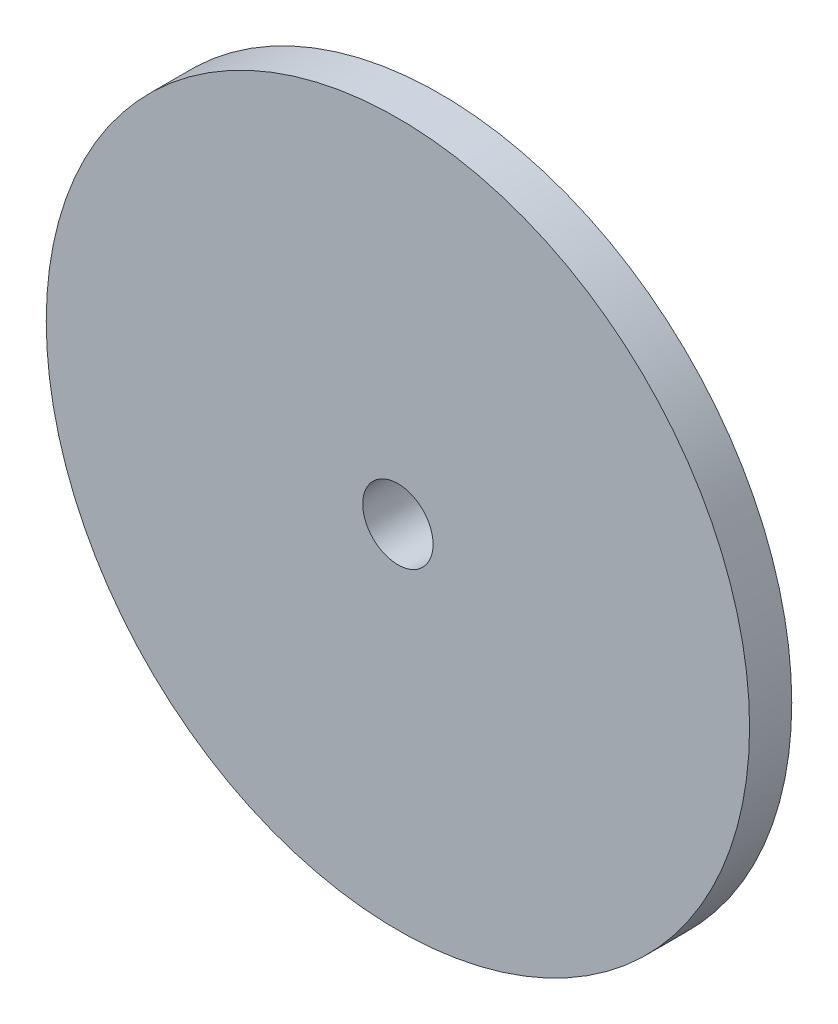
ISO-10303-21;
HEADER;
FILE_DESCRIPTION(('STEP AP214'),'2;1');
FILE_NAME('part.step','',(''),(''),'','','');
FILE_SCHEMA(('AUTOMOTIVE_DESIGN { 1 0 10303 214 1 1 1 1 }'));
ENDSEC;
DATA;
#1=APPLICATION_CONTEXT('core data for automotive mechanical design processes');
#2=APPLICATION_PROTOCOL_DEFINITION('international standard','automotive_design',2000,#1);
#3=PRODUCT_CONTEXT('',#1,'mechanical');
#4=PRODUCT('Part','Part','',(#3));
#5=PRODUCT_RELATED_PRODUCT_CATEGORY('part','',(#4));
#6=PRODUCT_DEFINITION_FORMATION('','',#4);
#7=PRODUCT_DEFINITION_CONTEXT('part definition',#1,'design');
#8=PRODUCT_DEFINITION('design','',#6,#7);
#9=PRODUCT_DEFINITION_SHAPE('','',#8);
#10=(LENGTH_UNIT() NAMED_UNIT(*) SI_UNIT(.MILLI.,.METRE.));
#11=(NAMED_UNIT(*) PLANE_ANGLE_UNIT() SI_UNIT($,.RADIAN.));
#12=(NAMED_UNIT(*) SI_UNIT($,.STERADIAN.) SOLID_ANGLE_UNIT());
#13=UNCERTAINTY_MEASURE_WITH_UNIT(LENGTH_MEASURE(1.E-05),#10,'distance_accuracy_value','');
#14=(GEOMETRIC_REPRESENTATION_CONTEXT(3) GLOBAL_UNCERTAINTY_ASSIGNED_CONTEXT((#13)) GLOBAL_UNIT_ASSIGNED_CONTEXT((#10,
#11,#12)) REPRESENTATION_CONTEXT('',''));
#15=CARTESIAN_POINT('',(0.,0.,0.));
#16=DIRECTION('',(0.,0.,1.));
#17=DIRECTION('',(1.,0.,0.));
#18=AXIS2_PLACEMENT_3D('',#15,#16,#17);
#19=CARTESIAN_POINT('',(-27.2623789677693,0.,-0.4));
#20=DIRECTION('',(0.,0.,1.));
#21=DIRECTION('',(1.,0.,0.));
#22=AXIS2_PLACEMENT_3D('',#19,#20,#21);
#23=CYLINDRICAL_SURFACE('',#22,1.25);
#24=CARTESIAN_POINT('',(-27.2623789677693,0.,-0.4));
#25=DIRECTION('',(0.,0.,1.));
#26=DIRECTION('',(1.,0.,0.));
#27=AXIS2_PLACEMENT_3D('',#24,#25,#26);
#28=CIRCLE('',#27,1.25);
#29=CARTESIAN_POINT('',(-26.0123789677693,0.,-0.4));
#30=VERTEX_POINT('',#29);
#31=EDGE_CURVE('E39',#30,#30,#28,.T.);
#32=ORIENTED_EDGE('',*,*,#31,.F.);
#33=EDGE_LOOP('',(#32));
#34=FACE_BOUND('',#33,.T.);
#35=CARTESIAN_POINT('',(-27.2623789677693,0.,1.5));
#36=DIRECTION('',(0.,0.,1.));
#37=DIRECTION('',(1.,0.,0.));
#38=AXIS2_PLACEMENT_3D('',#35,#36,#37);
#39=CIRCLE('',#38,1.25);
#40=CARTESIAN_POINT('',(-26.0123789677693,0.,1.5));
#41=VERTEX_POINT('',#40);
#42=EDGE_CURVE('E49',#41,#41,#39,.T.);
#43=ORIENTED_EDGE('',*,*,#42,.T.);
#44=EDGE_LOOP('',(#43));
#45=FACE_BOUND('',#44,.T.);
#46=ADVANCED_FACE('F32',(#34,#45),#23,.F.);
#47=CARTESIAN_POINT('',(-27.2623789677693,0.,-0.4));
#48=DIRECTION('',(0.,0.,1.));
#49=DIRECTION('',(1.,0.,0.));
#50=AXIS2_PLACEMENT_3D('',#47,#48,#49);
#51=CYLINDRICAL_SURFACE('',#50,6.);
#52=CARTESIAN_POINT('',(-27.2623789677693,0.,-0.4));
#53=DIRECTION('',(0.,0.,1.));
#54=DIRECTION('',(1.,0.,0.));
#55=AXIS2_PLACEMENT_3D('',#52,#53,#54);
#56=CIRCLE('',#55,6.);
#57=CARTESIAN_POINT('',(-21.2623789677693,0.,-0.4));
#58=VERTEX_POINT('',#57);
#59=EDGE_CURVE('E10',#58,#58,#56,.T.);
#60=ORIENTED_EDGE('',*,*,#59,.T.);
#61=EDGE_LOOP('',(#60));
#62=FACE_BOUND('',#61,.T.);
#63=CARTESIAN_POINT('',(-27.2623789677693,0.,0.));
#64=DIRECTION('',(0.,0.,1.));
#65=DIRECTION('',(1.,0.,0.));
#66=AXIS2_PLACEMENT_3D('',#63,#64,#65);
#67=CIRCLE('',#66,6.);
#68=CARTESIAN_POINT('',(-21.2623789677693,0.,0.));
#69=VERTEX_POINT('',#68);
#70=EDGE_CURVE('E35',#69,#69,#67,.T.);
#71=ORIENTED_EDGE('',*,*,#70,.F.);
#72=EDGE_LOOP('',(#71));
#73=FACE_BOUND('',#72,.T.);
#74=ADVANCED_FACE('F75',(#62,#73),#51,.T.);
#75=CARTESIAN_POINT('',(0.,0.,-0.4));
#76=DIRECTION('',(0.,0.,1.));
#77=DIRECTION('',(1.,0.,0.));
#78=AXIS2_PLACEMENT_3D('',#75,#76,#77);
#79=PLANE('',#78);
#80=ORIENTED_EDGE('',*,*,#31,.T.);
#81=EDGE_LOOP('',(#80));
#82=FACE_BOUND('',#81,.T.);
#83=ORIENTED_EDGE('',*,*,#59,.F.);
#84=EDGE_LOOP('',(#83));
#85=FACE_BOUND('',#84,.T.);
#86=ADVANCED_FACE('F61',(#82,#85),#79,.F.);
#87=CARTESIAN_POINT('',(-27.2623789677693,0.,1.5));
#88=DIRECTION('',(0.,0.,-1.));
#89=DIRECTION('',(-1.,0.,0.));
#90=AXIS2_PLACEMENT_3D('',#87,#88,#89);
#91=CYLINDRICAL_SURFACE('',#90,12.5);
#92=CARTESIAN_POINT('',(-27.2623789677693,0.,1.5));
#93=DIRECTION('',(0.,0.,1.));
#94=DIRECTION('',(1.,0.,0.));
#95=AXIS2_PLACEMENT_3D('',#92,#93,#94);
#96=CIRCLE('',#95,12.5);
#97=CARTESIAN_POINT('',(-14.7623789677693,0.,1.5));
#98=VERTEX_POINT('',#97);
#99=EDGE_CURVE('E48',#98,#98,#96,.T.);
#100=ORIENTED_EDGE('',*,*,#99,.F.);
#101=EDGE_LOOP('',(#100));
#102=FACE_BOUND('',#101,.T.);
#103=CARTESIAN_POINT('',(-27.2623789677693,0.,0.));
#104=DIRECTION('',(0.,0.,1.));
#105=DIRECTION('',(1.,0.,0.));
#106=AXIS2_PLACEMENT_3D('',#103,#104,#105);
#107=CIRCLE('',#106,12.5);
#108=CARTESIAN_POINT('',(-14.7623789677693,0.,0.));
#109=VERTEX_POINT('',#108);
#110=EDGE_CURVE('E45',#109,#109,#107,.T.);
#111=ORIENTED_EDGE('',*,*,#110,.T.);
#112=EDGE_LOOP('',(#111));
#113=FACE_BOUND('',#112,.T.);
#114=ADVANCED_FACE('F58',(#102,#113),#91,.T.);
#115=CARTESIAN_POINT('',(0.,0.,1.5));
#116=DIRECTION('',(0.,0.,1.));
#117=DIRECTION('',(1.,0.,0.));
#118=AXIS2_PLACEMENT_3D('',#115,#116,#117);
#119=PLANE('',#118);
#120=ORIENTED_EDGE('',*,*,#99,.T.);
#121=EDGE_LOOP('',(#120));
#122=FACE_BOUND('',#121,.T.);
#123=ORIENTED_EDGE('',*,*,#42,.F.);
#124=EDGE_LOOP('',(#123));
#125=FACE_BOUND('',#124,.T.);
#126=ADVANCED_FACE('F55',(#122,#125),#119,.T.);
#127=CARTESIAN_POINT('',(0.,0.,0.));
#128=DIRECTION('',(0.,0.,1.));
#129=DIRECTION('',(1.,0.,0.));
#130=AXIS2_PLACEMENT_3D('',#127,#128,#129);
#131=PLANE('',#130);
#132=ORIENTED_EDGE('',*,*,#70,.T.);
#133=EDGE_LOOP('',(#132));
#134=FACE_BOUND('',#133,.T.);
#135=ORIENTED_EDGE('',*,*,#110,.F.);
#136=EDGE_LOOP('',(#135));
#137=FACE_BOUND('',#136,.T.);
#138=ADVANCED_FACE('F65',(#134,#137),#131,.F.);
#139=CLOSED_SHELL('',(#46,#74,#86,#114,#126,#138));
#140=MANIFOLD_SOLID_BREP('B2',#139);
#141=ADVANCED_BREP_SHAPE_REPRESENTATION('',(#18,#140),#14);
#142=SHAPE_DEFINITION_REPRESENTATION(#9,#141);
ENDSEC;
END-ISO-10303-21;
